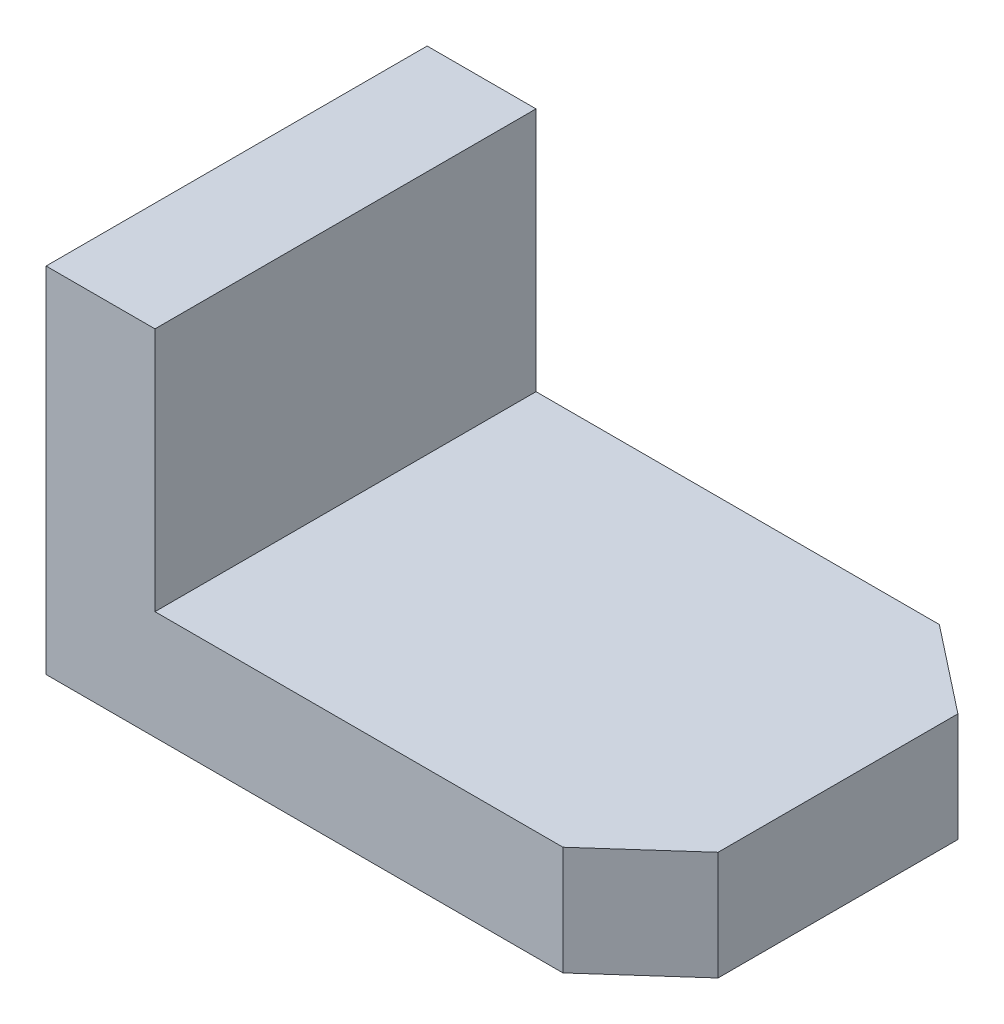
ISO-10303-21;
HEADER;
FILE_DESCRIPTION(('STEP AP214'),'2;1');
FILE_NAME('part.step','',(''),(''),'','','');
FILE_SCHEMA(('AUTOMOTIVE_DESIGN { 1 0 10303 214 1 1 1 1 }'));
ENDSEC;
DATA;
#1=APPLICATION_CONTEXT('core data for automotive mechanical design processes');
#2=APPLICATION_PROTOCOL_DEFINITION('international standard','automotive_design',2000,#1);
#3=PRODUCT_CONTEXT('',#1,'mechanical');
#4=PRODUCT('Part','Part','',(#3));
#5=PRODUCT_RELATED_PRODUCT_CATEGORY('part','',(#4));
#6=PRODUCT_DEFINITION_FORMATION('','',#4);
#7=PRODUCT_DEFINITION_CONTEXT('part definition',#1,'design');
#8=PRODUCT_DEFINITION('design','',#6,#7);
#9=PRODUCT_DEFINITION_SHAPE('','',#8);
#10=(LENGTH_UNIT() NAMED_UNIT(*) SI_UNIT(.MILLI.,.METRE.));
#11=(NAMED_UNIT(*) PLANE_ANGLE_UNIT() SI_UNIT($,.RADIAN.));
#12=(NAMED_UNIT(*) SI_UNIT($,.STERADIAN.) SOLID_ANGLE_UNIT());
#13=UNCERTAINTY_MEASURE_WITH_UNIT(LENGTH_MEASURE(1.E-05),#10,'distance_accuracy_value','');
#14=(GEOMETRIC_REPRESENTATION_CONTEXT(3) GLOBAL_UNCERTAINTY_ASSIGNED_CONTEXT((#13)) GLOBAL_UNIT_ASSIGNED_CONTEXT((#10,
#11,#12)) REPRESENTATION_CONTEXT('',''));
#15=CARTESIAN_POINT('',(0.,0.,0.));
#16=DIRECTION('',(0.,0.,1.));
#17=DIRECTION('',(1.,0.,0.));
#18=AXIS2_PLACEMENT_3D('',#15,#16,#17);
#19=CARTESIAN_POINT('',(0.,12.,0.));
#20=DIRECTION('',(0.,-1.,0.));
#21=DIRECTION('',(0.,0.,-1.));
#22=AXIS2_PLACEMENT_3D('',#19,#20,#21);
#23=PLANE('',#22);
#24=DIRECTION('',(1.,0.,0.));
#25=VECTOR('',#24,1.);
#26=CARTESIAN_POINT('',(-33.,12.,21.));
#27=LINE('',#26,#25);
#28=CARTESIAN_POINT('',(-21.,12.,21.));
#29=VERTEX_POINT('',#28);
#30=CARTESIAN_POINT('',(23.9653566140657,12.,21.));
#31=VERTEX_POINT('',#30);
#32=EDGE_CURVE('E137',#29,#31,#27,.T.);
#33=ORIENTED_EDGE('',*,*,#32,.T.);
#34=DIRECTION('',(-0.746037184688206,0.,0.665904286712809));
#35=VECTOR('',#34,1.);
#36=CARTESIAN_POINT('',(23.9653566140657,12.,21.));
#37=LINE('',#36,#35);
#38=CARTESIAN_POINT('',(33.,12.,12.9357803027881));
#39=VERTEX_POINT('',#38);
#40=EDGE_CURVE('E105',#39,#31,#37,.T.);
#41=ORIENTED_EDGE('',*,*,#40,.F.);
#42=DIRECTION('',(0.,0.,1.));
#43=VECTOR('',#42,1.);
#44=CARTESIAN_POINT('',(33.,12.,-21.));
#45=LINE('',#44,#43);
#46=CARTESIAN_POINT('',(33.,12.,-13.5));
#47=VERTEX_POINT('',#46);
#48=EDGE_CURVE('E113',#47,#39,#45,.T.);
#49=ORIENTED_EDGE('',*,*,#48,.F.);
#50=DIRECTION('',(0.786299748383108,0.,0.617845211758302));
#51=VECTOR('',#50,1.);
#52=CARTESIAN_POINT('',(33.,12.,-13.5));
#53=LINE('',#52,#51);
#54=CARTESIAN_POINT('',(23.4551366577875,12.,-21.));
#55=VERTEX_POINT('',#54);
#56=EDGE_CURVE('E160',#55,#47,#53,.T.);
#57=ORIENTED_EDGE('',*,*,#56,.F.);
#58=DIRECTION('',(1.,0.,0.));
#59=VECTOR('',#58,1.);
#60=CARTESIAN_POINT('',(-33.,12.,-21.));
#61=LINE('',#60,#59);
#62=CARTESIAN_POINT('',(-21.,12.,-21.));
#63=VERTEX_POINT('',#62);
#64=EDGE_CURVE('E128',#63,#55,#61,.T.);
#65=ORIENTED_EDGE('',*,*,#64,.F.);
#66=DIRECTION('',(0.,0.,-1.));
#67=VECTOR('',#66,1.);
#68=CARTESIAN_POINT('',(-21.,12.,-21.));
#69=LINE('',#68,#67);
#70=EDGE_CURVE('E114',#29,#63,#69,.T.);
#71=ORIENTED_EDGE('',*,*,#70,.F.);
#72=EDGE_LOOP('',(#33,#41,#49,#57,#65,#71));
#73=FACE_BOUND('',#72,.T.);
#74=ADVANCED_FACE('F35',(#73),#23,.F.);
#75=CARTESIAN_POINT('',(-33.,12.,-21.));
#76=DIRECTION('',(0.,0.,-1.));
#77=DIRECTION('',(-1.,0.,0.));
#78=AXIS2_PLACEMENT_3D('',#75,#76,#77);
#79=PLANE('',#78);
#80=DIRECTION('',(0.,1.,0.));
#81=VECTOR('',#80,1.);
#82=CARTESIAN_POINT('',(23.4551366577875,0.,-21.));
#83=LINE('',#82,#81);
#84=CARTESIAN_POINT('',(23.4551366577875,0.,-21.));
#85=VERTEX_POINT('',#84);
#86=EDGE_CURVE('E154',#85,#55,#83,.T.);
#87=ORIENTED_EDGE('',*,*,#86,.F.);
#88=DIRECTION('',(1.,0.,0.));
#89=VECTOR('',#88,1.);
#90=CARTESIAN_POINT('',(-33.,0.,-21.));
#91=LINE('',#90,#89);
#92=CARTESIAN_POINT('',(-33.,0.,-21.));
#93=VERTEX_POINT('',#92);
#94=EDGE_CURVE('E120',#93,#85,#91,.T.);
#95=ORIENTED_EDGE('',*,*,#94,.F.);
#96=DIRECTION('',(0.,-1.,0.));
#97=VECTOR('',#96,1.);
#98=CARTESIAN_POINT('',(-33.,12.,-21.));
#99=LINE('',#98,#97);
#100=CARTESIAN_POINT('',(-33.,38.9950424980755,-21.));
#101=VERTEX_POINT('',#100);
#102=EDGE_CURVE('E11',#101,#93,#99,.T.);
#103=ORIENTED_EDGE('',*,*,#102,.F.);
#104=DIRECTION('',(-1.,0.,0.));
#105=VECTOR('',#104,1.);
#106=CARTESIAN_POINT('',(-33.,38.9950424980755,-21.));
#107=LINE('',#106,#105);
#108=CARTESIAN_POINT('',(-21.,38.9950424980755,-21.));
#109=VERTEX_POINT('',#108);
#110=EDGE_CURVE('E168',#109,#101,#107,.T.);
#111=ORIENTED_EDGE('',*,*,#110,.F.);
#112=DIRECTION('',(0.,-1.,0.));
#113=VECTOR('',#112,1.);
#114=CARTESIAN_POINT('',(-21.,38.9950424980755,-21.));
#115=LINE('',#114,#113);
#116=EDGE_CURVE('E170',#109,#63,#115,.T.);
#117=ORIENTED_EDGE('',*,*,#116,.T.);
#118=ORIENTED_EDGE('',*,*,#64,.T.);
#119=EDGE_LOOP('',(#87,#95,#103,#111,#117,#118));
#120=FACE_BOUND('',#119,.T.);
#121=ADVANCED_FACE('F37',(#120),#79,.T.);
#122=CARTESIAN_POINT('',(-33.,12.,-21.));
#123=DIRECTION('',(1.,0.,0.));
#124=DIRECTION('',(0.,0.,-1.));
#125=AXIS2_PLACEMENT_3D('',#122,#123,#124);
#126=PLANE('',#125);
#127=DIRECTION('',(0.,0.,1.));
#128=VECTOR('',#127,1.);
#129=CARTESIAN_POINT('',(-33.,0.,-21.));
#130=LINE('',#129,#128);
#131=CARTESIAN_POINT('',(-33.,0.,21.));
#132=VERTEX_POINT('',#131);
#133=EDGE_CURVE('E122',#93,#132,#130,.T.);
#134=ORIENTED_EDGE('',*,*,#133,.T.);
#135=DIRECTION('',(0.,-1.,0.));
#136=VECTOR('',#135,1.);
#137=CARTESIAN_POINT('',(-33.,12.,21.));
#138=LINE('',#137,#136);
#139=CARTESIAN_POINT('',(-33.,38.9950424980755,21.));
#140=VERTEX_POINT('',#139);
#141=EDGE_CURVE('E39',#140,#132,#138,.T.);
#142=ORIENTED_EDGE('',*,*,#141,.F.);
#143=DIRECTION('',(0.,0.,1.));
#144=VECTOR('',#143,1.);
#145=CARTESIAN_POINT('',(-33.,38.9950424980755,-21.));
#146=LINE('',#145,#144);
#147=EDGE_CURVE('E163',#101,#140,#146,.T.);
#148=ORIENTED_EDGE('',*,*,#147,.F.);
#149=ORIENTED_EDGE('',*,*,#102,.T.);
#150=EDGE_LOOP('',(#134,#142,#148,#149));
#151=FACE_BOUND('',#150,.T.);
#152=ADVANCED_FACE('F184',(#151),#126,.F.);
#153=CARTESIAN_POINT('',(-33.,12.,21.));
#154=DIRECTION('',(0.,0.,-1.));
#155=DIRECTION('',(-1.,0.,0.));
#156=AXIS2_PLACEMENT_3D('',#153,#154,#155);
#157=PLANE('',#156);
#158=DIRECTION('',(1.,0.,0.));
#159=VECTOR('',#158,1.);
#160=CARTESIAN_POINT('',(-33.,0.,21.));
#161=LINE('',#160,#159);
#162=CARTESIAN_POINT('',(23.9653566140657,0.,21.));
#163=VERTEX_POINT('',#162);
#164=EDGE_CURVE('E119',#132,#163,#161,.T.);
#165=ORIENTED_EDGE('',*,*,#164,.T.);
#166=DIRECTION('',(0.,1.,0.));
#167=VECTOR('',#166,1.);
#168=CARTESIAN_POINT('',(23.9653566140657,0.,21.));
#169=LINE('',#168,#167);
#170=EDGE_CURVE('E50',#163,#31,#169,.T.);
#171=ORIENTED_EDGE('',*,*,#170,.T.);
#172=ORIENTED_EDGE('',*,*,#32,.F.);
#173=DIRECTION('',(0.,-1.,0.));
#174=VECTOR('',#173,1.);
#175=CARTESIAN_POINT('',(-21.,38.9950424980755,21.));
#176=LINE('',#175,#174);
#177=CARTESIAN_POINT('',(-21.,38.9950424980755,21.));
#178=VERTEX_POINT('',#177);
#179=EDGE_CURVE('E124',#178,#29,#176,.T.);
#180=ORIENTED_EDGE('',*,*,#179,.F.);
#181=DIRECTION('',(1.,0.,0.));
#182=VECTOR('',#181,1.);
#183=CARTESIAN_POINT('',(-33.,38.9950424980755,21.));
#184=LINE('',#183,#182);
#185=EDGE_CURVE('E148',#140,#178,#184,.T.);
#186=ORIENTED_EDGE('',*,*,#185,.F.);
#187=ORIENTED_EDGE('',*,*,#141,.T.);
#188=EDGE_LOOP('',(#165,#171,#172,#180,#186,#187));
#189=FACE_BOUND('',#188,.T.);
#190=ADVANCED_FACE('F146',(#189),#157,.F.);
#191=CARTESIAN_POINT('',(33.,12.,-21.));
#192=DIRECTION('',(1.,0.,0.));
#193=DIRECTION('',(0.,0.,-1.));
#194=AXIS2_PLACEMENT_3D('',#191,#192,#193);
#195=PLANE('',#194);
#196=DIRECTION('',(0.,1.,0.));
#197=VECTOR('',#196,1.);
#198=CARTESIAN_POINT('',(33.,0.,12.9357803027881));
#199=LINE('',#198,#197);
#200=CARTESIAN_POINT('',(33.,0.,12.9357803027881));
#201=VERTEX_POINT('',#200);
#202=EDGE_CURVE('E99',#201,#39,#199,.T.);
#203=ORIENTED_EDGE('',*,*,#202,.F.);
#204=DIRECTION('',(0.,0.,1.));
#205=VECTOR('',#204,1.);
#206=CARTESIAN_POINT('',(33.,0.,-21.));
#207=LINE('',#206,#205);
#208=CARTESIAN_POINT('',(33.,0.,-13.5));
#209=VERTEX_POINT('',#208);
#210=EDGE_CURVE('E111',#209,#201,#207,.T.);
#211=ORIENTED_EDGE('',*,*,#210,.F.);
#212=DIRECTION('',(0.,1.,0.));
#213=VECTOR('',#212,1.);
#214=CARTESIAN_POINT('',(33.,0.,-13.5));
#215=LINE('',#214,#213);
#216=EDGE_CURVE('E58',#209,#47,#215,.T.);
#217=ORIENTED_EDGE('',*,*,#216,.T.);
#218=ORIENTED_EDGE('',*,*,#48,.T.);
#219=EDGE_LOOP('',(#203,#211,#217,#218));
#220=FACE_BOUND('',#219,.T.);
#221=ADVANCED_FACE('F110',(#220),#195,.T.);
#222=CARTESIAN_POINT('',(0.,0.,0.));
#223=DIRECTION('',(0.,-1.,0.));
#224=DIRECTION('',(0.,0.,-1.));
#225=AXIS2_PLACEMENT_3D('',#222,#223,#224);
#226=PLANE('',#225);
#227=DIRECTION('',(-0.746037184688206,0.,0.665904286712809));
#228=VECTOR('',#227,1.);
#229=CARTESIAN_POINT('',(23.9653566140657,0.,21.));
#230=LINE('',#229,#228);
#231=EDGE_CURVE('E96',#201,#163,#230,.T.);
#232=ORIENTED_EDGE('',*,*,#231,.T.);
#233=ORIENTED_EDGE('',*,*,#164,.F.);
#234=ORIENTED_EDGE('',*,*,#133,.F.);
#235=ORIENTED_EDGE('',*,*,#94,.T.);
#236=DIRECTION('',(0.786299748383108,0.,0.617845211758302));
#237=VECTOR('',#236,1.);
#238=CARTESIAN_POINT('',(33.,0.,-13.5));
#239=LINE('',#238,#237);
#240=EDGE_CURVE('E118',#85,#209,#239,.T.);
#241=ORIENTED_EDGE('',*,*,#240,.T.);
#242=ORIENTED_EDGE('',*,*,#210,.T.);
#243=EDGE_LOOP('',(#232,#233,#234,#235,#241,#242));
#244=FACE_BOUND('',#243,.T.);
#245=ADVANCED_FACE('F116',(#244),#226,.T.);
#246=CARTESIAN_POINT('',(-21.,38.9950424980755,-21.));
#247=DIRECTION('',(-1.,0.,0.));
#248=DIRECTION('',(0.,0.,1.));
#249=AXIS2_PLACEMENT_3D('',#246,#247,#248);
#250=PLANE('',#249);
#251=ORIENTED_EDGE('',*,*,#70,.T.);
#252=ORIENTED_EDGE('',*,*,#116,.F.);
#253=DIRECTION('',(0.,0.,-1.));
#254=VECTOR('',#253,1.);
#255=CARTESIAN_POINT('',(-21.,38.9950424980755,-21.));
#256=LINE('',#255,#254);
#257=EDGE_CURVE('E166',#178,#109,#256,.T.);
#258=ORIENTED_EDGE('',*,*,#257,.F.);
#259=ORIENTED_EDGE('',*,*,#179,.T.);
#260=EDGE_LOOP('',(#251,#252,#258,#259));
#261=FACE_BOUND('',#260,.T.);
#262=ADVANCED_FACE('F176',(#261),#250,.F.);
#263=CARTESIAN_POINT('',(0.,38.9950424980755,0.));
#264=DIRECTION('',(0.,1.,0.));
#265=DIRECTION('',(0.,0.,1.));
#266=AXIS2_PLACEMENT_3D('',#263,#264,#265);
#267=PLANE('',#266);
#268=ORIENTED_EDGE('',*,*,#147,.T.);
#269=ORIENTED_EDGE('',*,*,#185,.T.);
#270=ORIENTED_EDGE('',*,*,#257,.T.);
#271=ORIENTED_EDGE('',*,*,#110,.T.);
#272=EDGE_LOOP('',(#268,#269,#270,#271));
#273=FACE_BOUND('',#272,.T.);
#274=ADVANCED_FACE('F209',(#273),#267,.T.);
#275=CARTESIAN_POINT('',(33.,0.,-13.5));
#276=DIRECTION('',(-0.617845211758302,0.,0.786299748383108));
#277=DIRECTION('',(0.786299748383108,0.,0.617845211758302));
#278=AXIS2_PLACEMENT_3D('',#275,#276,#277);
#279=PLANE('',#278);
#280=ORIENTED_EDGE('',*,*,#56,.T.);
#281=ORIENTED_EDGE('',*,*,#216,.F.);
#282=ORIENTED_EDGE('',*,*,#240,.F.);
#283=ORIENTED_EDGE('',*,*,#86,.T.);
#284=EDGE_LOOP('',(#280,#281,#282,#283));
#285=FACE_BOUND('',#284,.T.);
#286=ADVANCED_FACE('F178',(#285),#279,.F.);
#287=CARTESIAN_POINT('',(23.9653566140657,0.,21.));
#288=DIRECTION('',(-0.66590428671281,0.,-0.746037184688206));
#289=DIRECTION('',(-0.746037184688206,0.,0.66590428671281));
#290=AXIS2_PLACEMENT_3D('',#287,#288,#289);
#291=PLANE('',#290);
#292=ORIENTED_EDGE('',*,*,#40,.T.);
#293=ORIENTED_EDGE('',*,*,#170,.F.);
#294=ORIENTED_EDGE('',*,*,#231,.F.);
#295=ORIENTED_EDGE('',*,*,#202,.T.);
#296=EDGE_LOOP('',(#292,#293,#294,#295));
#297=FACE_BOUND('',#296,.T.);
#298=ADVANCED_FACE('F98',(#297),#291,.F.);
#299=CLOSED_SHELL('',(#74,#121,#152,#190,#221,#245,#262,#274,#286,#298));
#300=MANIFOLD_SOLID_BREP('B2',#299);
#301=ADVANCED_BREP_SHAPE_REPRESENTATION('',(#18,#300),#14);
#302=SHAPE_DEFINITION_REPRESENTATION(#9,#301);
ENDSEC;
END-ISO-10303-21;
